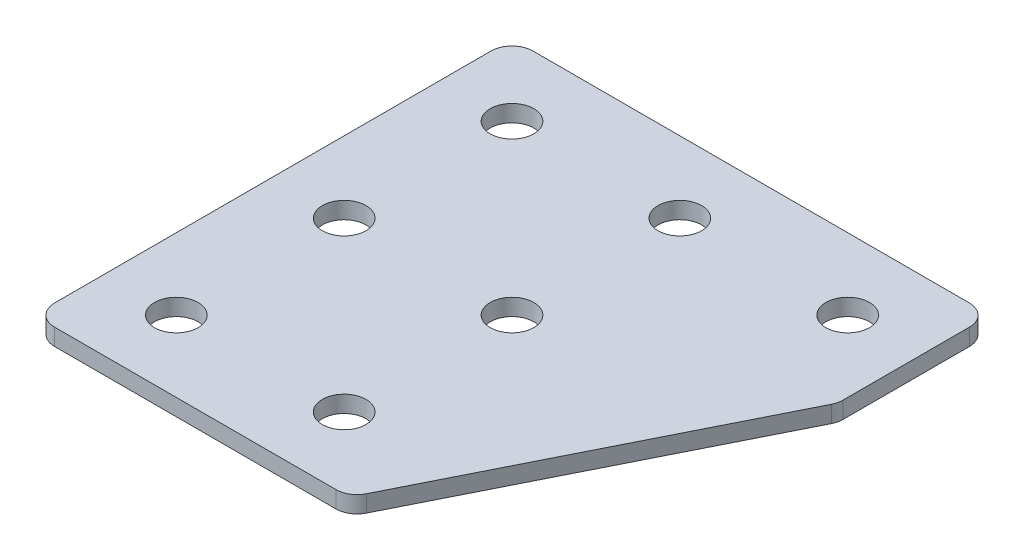
ISO-10303-21;
HEADER;
FILE_DESCRIPTION(('STEP AP214'),'2;1');
FILE_NAME('part.step','',(''),(''),'','','');
FILE_SCHEMA(('AUTOMOTIVE_DESIGN { 1 0 10303 214 1 1 1 1 }'));
ENDSEC;
DATA;
#1=APPLICATION_CONTEXT('core data for automotive mechanical design processes');
#2=APPLICATION_PROTOCOL_DEFINITION('international standard','automotive_design',2000,#1);
#3=PRODUCT_CONTEXT('',#1,'mechanical');
#4=PRODUCT('Part','Part','',(#3));
#5=PRODUCT_RELATED_PRODUCT_CATEGORY('part','',(#4));
#6=PRODUCT_DEFINITION_FORMATION('','',#4);
#7=PRODUCT_DEFINITION_CONTEXT('part definition',#1,'design');
#8=PRODUCT_DEFINITION('design','',#6,#7);
#9=PRODUCT_DEFINITION_SHAPE('','',#8);
#10=(LENGTH_UNIT() NAMED_UNIT(*) SI_UNIT(.MILLI.,.METRE.));
#11=(NAMED_UNIT(*) PLANE_ANGLE_UNIT() SI_UNIT($,.RADIAN.));
#12=(NAMED_UNIT(*) SI_UNIT($,.STERADIAN.) SOLID_ANGLE_UNIT());
#13=UNCERTAINTY_MEASURE_WITH_UNIT(LENGTH_MEASURE(1.E-05),#10,'distance_accuracy_value','');
#14=(GEOMETRIC_REPRESENTATION_CONTEXT(3) GLOBAL_UNCERTAINTY_ASSIGNED_CONTEXT((#13)) GLOBAL_UNIT_ASSIGNED_CONTEXT((#10,
#11,#12)) REPRESENTATION_CONTEXT('',''));
#15=CARTESIAN_POINT('',(0.,0.,0.));
#16=DIRECTION('',(0.,0.,1.));
#17=DIRECTION('',(1.,0.,0.));
#18=AXIS2_PLACEMENT_3D('',#15,#16,#17);
#19=CARTESIAN_POINT('',(-11.2369089429852,1.27470932668439,-21.0374307097436));
#20=DIRECTION('',(0.,-1.,0.));
#21=DIRECTION('',(0.,0.,-1.));
#22=AXIS2_PLACEMENT_3D('',#19,#20,#21);
#23=PLANE('',#22);
#24=CARTESIAN_POINT('',(-1.23690894298524,1.27470932668439,18.9625692902565));
#25=DIRECTION('',(0.,1.,0.));
#26=DIRECTION('',(0.,0.,1.));
#27=AXIS2_PLACEMENT_3D('',#24,#25,#26);
#28=CIRCLE('',#27,2.6);
#29=CARTESIAN_POINT('',(-1.23690894298524,1.27470932668439,21.5625692902565));
#30=VERTEX_POINT('',#29);
#31=EDGE_CURVE('E257',#30,#30,#28,.T.);
#32=ORIENTED_EDGE('',*,*,#31,.T.);
#33=EDGE_LOOP('',(#32));
#34=FACE_BOUND('',#33,.T.);
#35=CARTESIAN_POINT('',(-21.2369089429853,1.27470932668439,18.9625692902565));
#36=DIRECTION('',(0.,1.,0.));
#37=DIRECTION('',(0.,0.,1.));
#38=AXIS2_PLACEMENT_3D('',#35,#36,#37);
#39=CIRCLE('',#38,2.6);
#40=CARTESIAN_POINT('',(-21.2369089429853,1.27470932668439,21.5625692902565));
#41=VERTEX_POINT('',#40);
#42=EDGE_CURVE('E265',#41,#41,#39,.T.);
#43=ORIENTED_EDGE('',*,*,#42,.T.);
#44=EDGE_LOOP('',(#43));
#45=FACE_BOUND('',#44,.T.);
#46=CARTESIAN_POINT('',(-1.23690894298524,1.27470932668439,-1.03743070974355));
#47=DIRECTION('',(0.,1.,0.));
#48=DIRECTION('',(0.,0.,1.));
#49=AXIS2_PLACEMENT_3D('',#46,#47,#48);
#50=CIRCLE('',#49,2.6);
#51=CARTESIAN_POINT('',(-1.23690894298524,1.27470932668439,1.56256929025645));
#52=VERTEX_POINT('',#51);
#53=EDGE_CURVE('E271',#52,#52,#50,.T.);
#54=ORIENTED_EDGE('',*,*,#53,.T.);
#55=EDGE_LOOP('',(#54));
#56=FACE_BOUND('',#55,.T.);
#57=CARTESIAN_POINT('',(-21.2369089429853,1.27470932668439,-1.03743070974355));
#58=DIRECTION('',(0.,1.,0.));
#59=DIRECTION('',(0.,0.,1.));
#60=AXIS2_PLACEMENT_3D('',#57,#58,#59);
#61=CIRCLE('',#60,2.6);
#62=CARTESIAN_POINT('',(-21.2369089429853,1.27470932668439,1.56256929025645));
#63=VERTEX_POINT('',#62);
#64=EDGE_CURVE('E277',#63,#63,#61,.T.);
#65=ORIENTED_EDGE('',*,*,#64,.T.);
#66=EDGE_LOOP('',(#65));
#67=FACE_BOUND('',#66,.T.);
#68=CARTESIAN_POINT('',(18.7630910570148,1.27470932668439,-21.0374307097436));
#69=DIRECTION('',(0.,1.,0.));
#70=DIRECTION('',(0.,0.,1.));
#71=AXIS2_PLACEMENT_3D('',#68,#69,#70);
#72=CIRCLE('',#71,2.6);
#73=CARTESIAN_POINT('',(18.7630910570148,1.27470932668439,-18.4374307097436));
#74=VERTEX_POINT('',#73);
#75=EDGE_CURVE('E283',#74,#74,#72,.T.);
#76=ORIENTED_EDGE('',*,*,#75,.T.);
#77=EDGE_LOOP('',(#76));
#78=FACE_BOUND('',#77,.T.);
#79=CARTESIAN_POINT('',(-1.23690894298523,1.27470932668439,-21.0374307097436));
#80=DIRECTION('',(0.,1.,0.));
#81=DIRECTION('',(0.,0.,1.));
#82=AXIS2_PLACEMENT_3D('',#79,#80,#81);
#83=CIRCLE('',#82,2.6);
#84=CARTESIAN_POINT('',(-1.23690894298523,1.27470932668439,-18.4374307097436));
#85=VERTEX_POINT('',#84);
#86=EDGE_CURVE('E289',#85,#85,#83,.T.);
#87=ORIENTED_EDGE('',*,*,#86,.T.);
#88=EDGE_LOOP('',(#87));
#89=FACE_BOUND('',#88,.T.);
#90=CARTESIAN_POINT('',(-21.2369089429853,1.27470932668439,-21.0374307097436));
#91=DIRECTION('',(0.,1.,0.));
#92=DIRECTION('',(0.,0.,1.));
#93=AXIS2_PLACEMENT_3D('',#90,#91,#92);
#94=CIRCLE('',#93,2.6);
#95=CARTESIAN_POINT('',(-21.2369089429853,1.27470932668439,-18.4374307097436));
#96=VERTEX_POINT('',#95);
#97=EDGE_CURVE('E176',#96,#96,#94,.T.);
#98=ORIENTED_EDGE('',*,*,#97,.T.);
#99=EDGE_LOOP('',(#98));
#100=FACE_BOUND('',#99,.T.);
#101=DIRECTION('',(1.,0.,0.));
#102=VECTOR('',#101,1.);
#103=CARTESIAN_POINT('',(-29.7369089429853,1.27470932668439,27.4625692902564));
#104=LINE('',#103,#102);
#105=CARTESIAN_POINT('',(-27.2369089429853,1.27470932668439,27.4625692902564));
#106=VERTEX_POINT('',#105);
#107=CARTESIAN_POINT('',(6.29095510201524,1.27470932668439,27.4625692902564));
#108=VERTEX_POINT('',#107);
#109=EDGE_CURVE('E165',#106,#108,#104,.T.);
#110=ORIENTED_EDGE('',*,*,#109,.F.);
#111=CARTESIAN_POINT('',(-27.2369089429853,1.27470932668439,24.9625692902564));
#112=DIRECTION('',(0.,-1.,0.));
#113=DIRECTION('',(0.,0.,-1.));
#114=AXIS2_PLACEMENT_3D('',#111,#112,#113);
#115=CIRCLE('',#114,2.5);
#116=CARTESIAN_POINT('',(-29.7369089429853,1.27470932668439,24.9625692902564));
#117=VERTEX_POINT('',#116);
#118=EDGE_CURVE('E146',#106,#117,#115,.T.);
#119=ORIENTED_EDGE('',*,*,#118,.T.);
#120=DIRECTION('',(0.,0.,1.));
#121=VECTOR('',#120,1.);
#122=CARTESIAN_POINT('',(-29.7369089429853,1.27470932668439,-29.5374307097436));
#123=LINE('',#122,#121);
#124=CARTESIAN_POINT('',(-29.7369089429853,1.27470932668439,-27.0374307097436));
#125=VERTEX_POINT('',#124);
#126=EDGE_CURVE('E163',#125,#117,#123,.T.);
#127=ORIENTED_EDGE('',*,*,#126,.F.);
#128=CARTESIAN_POINT('',(-27.2369089429853,1.27470932668439,-27.0374307097436));
#129=DIRECTION('',(0.,-1.,0.));
#130=DIRECTION('',(0.,0.,-1.));
#131=AXIS2_PLACEMENT_3D('',#128,#129,#130);
#132=CIRCLE('',#131,2.5);
#133=CARTESIAN_POINT('',(-27.2369089429853,1.27470932668439,-29.5374307097436));
#134=VERTEX_POINT('',#133);
#135=EDGE_CURVE('E117',#125,#134,#132,.T.);
#136=ORIENTED_EDGE('',*,*,#135,.T.);
#137=DIRECTION('',(-1.,0.,0.));
#138=VECTOR('',#137,1.);
#139=CARTESIAN_POINT('',(27.2630910570147,1.27470932668439,-29.5374307097436));
#140=LINE('',#139,#138);
#141=CARTESIAN_POINT('',(24.7630910570147,1.27470932668439,-29.5374307097436));
#142=VERTEX_POINT('',#141);
#143=EDGE_CURVE('E161',#142,#134,#140,.T.);
#144=ORIENTED_EDGE('',*,*,#143,.F.);
#145=CARTESIAN_POINT('',(24.7630910570147,1.27470932668439,-27.0374307097436));
#146=DIRECTION('',(0.,-1.,0.));
#147=DIRECTION('',(0.,0.,-1.));
#148=AXIS2_PLACEMENT_3D('',#145,#146,#147);
#149=CIRCLE('',#148,2.5);
#150=CARTESIAN_POINT('',(27.2630910570147,1.27470932668439,-27.0374307097436));
#151=VERTEX_POINT('',#150);
#152=EDGE_CURVE('E141',#142,#151,#149,.T.);
#153=ORIENTED_EDGE('',*,*,#152,.T.);
#154=DIRECTION('',(0.,0.,-1.));
#155=VECTOR('',#154,1.);
#156=CARTESIAN_POINT('',(27.2630910570147,1.27470932668439,-11.3915326759932));
#157=LINE('',#156,#155);
#158=CARTESIAN_POINT('',(27.2630910570147,1.27470932668439,-11.9817026197427));
#159=VERTEX_POINT('',#158);
#160=EDGE_CURVE('E118',#159,#151,#157,.T.);
#161=ORIENTED_EDGE('',*,*,#160,.F.);
#162=CARTESIAN_POINT('',(24.7630910570147,1.27470932668439,-11.9817026197427));
#163=DIRECTION('',(0.,-1.,0.));
#164=DIRECTION('',(0.,0.,-1.));
#165=AXIS2_PLACEMENT_3D('',#162,#163,#164);
#166=CIRCLE('',#165,2.5);
#167=CARTESIAN_POINT('',(26.9991590345144,1.27470932668439,-10.8636686309928));
#168=VERTEX_POINT('',#167);
#169=EDGE_CURVE('E31',#159,#168,#166,.T.);
#170=ORIENTED_EDGE('',*,*,#169,.T.);
#171=DIRECTION('',(0.447213595499955,0.,-0.894427190999917));
#172=VECTOR('',#171,1.);
#173=CARTESIAN_POINT('',(7.83604007388999,1.27470932668439,27.4625692902564));
#174=LINE('',#173,#172);
#175=CARTESIAN_POINT('',(8.52702307951504,1.27470932668439,26.0806032790063));
#176=VERTEX_POINT('',#175);
#177=EDGE_CURVE('E122',#176,#168,#174,.T.);
#178=ORIENTED_EDGE('',*,*,#177,.F.);
#179=CARTESIAN_POINT('',(6.29095510201524,1.27470932668439,24.9625692902564));
#180=DIRECTION('',(0.,-1.,0.));
#181=DIRECTION('',(0.,0.,-1.));
#182=AXIS2_PLACEMENT_3D('',#179,#180,#181);
#183=CIRCLE('',#182,2.5);
#184=EDGE_CURVE('E144',#176,#108,#183,.T.);
#185=ORIENTED_EDGE('',*,*,#184,.T.);
#186=EDGE_LOOP('',(#110,#119,#127,#136,#144,#153,#161,#170,#178,#185));
#187=FACE_BOUND('',#186,.T.);
#188=ADVANCED_FACE('F16',(#34,#45,#56,#67,#78,#89,#100,#187),#23,.T.);
#189=CARTESIAN_POINT('',(27.2630910570147,1.27470932668439,-29.5374307097436));
#190=DIRECTION('',(0.,0.,-1.));
#191=DIRECTION('',(-1.,0.,0.));
#192=AXIS2_PLACEMENT_3D('',#189,#190,#191);
#193=PLANE('',#192);
#194=DIRECTION('',(-1.,0.,0.));
#195=VECTOR('',#194,1.);
#196=CARTESIAN_POINT('',(27.2630910570147,3.27470932668439,-29.5374307097436));
#197=LINE('',#196,#195);
#198=CARTESIAN_POINT('',(24.7630910570147,3.27470932668439,-29.5374307097436));
#199=VERTEX_POINT('',#198);
#200=CARTESIAN_POINT('',(-27.2369089429853,3.27470932668439,-29.5374307097436));
#201=VERTEX_POINT('',#200);
#202=EDGE_CURVE('E99',#199,#201,#197,.T.);
#203=ORIENTED_EDGE('',*,*,#202,.F.);
#204=DIRECTION('',(0.,1.,0.));
#205=VECTOR('',#204,1.);
#206=CARTESIAN_POINT('',(24.7630910570147,1.27470932668439,-29.5374307097436));
#207=LINE('',#206,#205);
#208=EDGE_CURVE('E10',#199,#142,#207,.F.);
#209=ORIENTED_EDGE('',*,*,#208,.T.);
#210=ORIENTED_EDGE('',*,*,#143,.T.);
#211=DIRECTION('',(0.,1.,0.));
#212=VECTOR('',#211,1.);
#213=CARTESIAN_POINT('',(-27.2369089429853,1.27470932668439,-29.5374307097436));
#214=LINE('',#213,#212);
#215=EDGE_CURVE('E24',#134,#201,#214,.T.);
#216=ORIENTED_EDGE('',*,*,#215,.T.);
#217=EDGE_LOOP('',(#203,#209,#210,#216));
#218=FACE_BOUND('',#217,.T.);
#219=ADVANCED_FACE('F158',(#218),#193,.T.);
#220=CARTESIAN_POINT('',(27.2630910570147,1.27470932668439,-11.3915326759932));
#221=DIRECTION('',(1.,0.,0.));
#222=DIRECTION('',(0.,0.,-1.));
#223=AXIS2_PLACEMENT_3D('',#220,#221,#222);
#224=PLANE('',#223);
#225=DIRECTION('',(0.,0.,-1.));
#226=VECTOR('',#225,1.);
#227=CARTESIAN_POINT('',(27.2630910570147,3.27470932668439,-11.3915326759932));
#228=LINE('',#227,#226);
#229=CARTESIAN_POINT('',(27.2630910570147,3.27470932668439,-11.9817026197427));
#230=VERTEX_POINT('',#229);
#231=CARTESIAN_POINT('',(27.2630910570147,3.27470932668439,-27.0374307097436));
#232=VERTEX_POINT('',#231);
#233=EDGE_CURVE('E125',#230,#232,#228,.T.);
#234=ORIENTED_EDGE('',*,*,#233,.F.);
#235=DIRECTION('',(0.,1.,0.));
#236=VECTOR('',#235,1.);
#237=CARTESIAN_POINT('',(27.2630910570147,1.27470932668439,-11.9817026197427));
#238=LINE('',#237,#236);
#239=EDGE_CURVE('E155',#230,#159,#238,.F.);
#240=ORIENTED_EDGE('',*,*,#239,.T.);
#241=ORIENTED_EDGE('',*,*,#160,.T.);
#242=DIRECTION('',(0.,1.,0.));
#243=VECTOR('',#242,1.);
#244=CARTESIAN_POINT('',(27.2630910570147,1.27470932668439,-27.0374307097436));
#245=LINE('',#244,#243);
#246=EDGE_CURVE('E152',#151,#232,#245,.T.);
#247=ORIENTED_EDGE('',*,*,#246,.T.);
#248=EDGE_LOOP('',(#234,#240,#241,#247));
#249=FACE_BOUND('',#248,.T.);
#250=ADVANCED_FACE('F212',(#249),#224,.T.);
#251=CARTESIAN_POINT('',(7.83604007388999,1.27470932668439,27.4625692902564));
#252=DIRECTION('',(0.894427190999917,0.,0.447213595499955));
#253=DIRECTION('',(0.447213595499955,0.,-0.894427190999917));
#254=AXIS2_PLACEMENT_3D('',#251,#252,#253);
#255=PLANE('',#254);
#256=DIRECTION('',(0.447213595499955,0.,-0.894427190999917));
#257=VECTOR('',#256,1.);
#258=CARTESIAN_POINT('',(7.83604007388999,3.27470932668439,27.4625692902564));
#259=LINE('',#258,#257);
#260=CARTESIAN_POINT('',(8.52702307951504,3.27470932668439,26.0806032790063));
#261=VERTEX_POINT('',#260);
#262=CARTESIAN_POINT('',(26.9991590345144,3.27470932668439,-10.8636686309928));
#263=VERTEX_POINT('',#262);
#264=EDGE_CURVE('E168',#261,#263,#259,.T.);
#265=ORIENTED_EDGE('',*,*,#264,.F.);
#266=DIRECTION('',(0.,1.,0.));
#267=VECTOR('',#266,1.);
#268=CARTESIAN_POINT('',(8.52702307951504,1.27470932668439,26.0806032790063));
#269=LINE('',#268,#267);
#270=EDGE_CURVE('E38',#261,#176,#269,.F.);
#271=ORIENTED_EDGE('',*,*,#270,.T.);
#272=ORIENTED_EDGE('',*,*,#177,.T.);
#273=DIRECTION('',(0.,1.,0.));
#274=VECTOR('',#273,1.);
#275=CARTESIAN_POINT('',(26.9991590345145,1.27470932668439,-10.8636686309928));
#276=LINE('',#275,#274);
#277=EDGE_CURVE('E148',#168,#263,#276,.T.);
#278=ORIENTED_EDGE('',*,*,#277,.T.);
#279=EDGE_LOOP('',(#265,#271,#272,#278));
#280=FACE_BOUND('',#279,.T.);
#281=ADVANCED_FACE('F181',(#280),#255,.T.);
#282=CARTESIAN_POINT('',(-29.7369089429853,1.27470932668439,27.4625692902564));
#283=DIRECTION('',(0.,0.,1.));
#284=DIRECTION('',(1.,0.,0.));
#285=AXIS2_PLACEMENT_3D('',#282,#283,#284);
#286=PLANE('',#285);
#287=DIRECTION('',(1.,0.,0.));
#288=VECTOR('',#287,1.);
#289=CARTESIAN_POINT('',(-29.7369089429853,3.27470932668439,27.4625692902564));
#290=LINE('',#289,#288);
#291=CARTESIAN_POINT('',(-27.2369089429853,3.27470932668439,27.4625692902564));
#292=VERTEX_POINT('',#291);
#293=CARTESIAN_POINT('',(6.29095510201524,3.27470932668439,27.4625692902564));
#294=VERTEX_POINT('',#293);
#295=EDGE_CURVE('E114',#292,#294,#290,.T.);
#296=ORIENTED_EDGE('',*,*,#295,.F.);
#297=DIRECTION('',(0.,1.,0.));
#298=VECTOR('',#297,1.);
#299=CARTESIAN_POINT('',(-27.2369089429853,1.27470932668439,27.4625692902564));
#300=LINE('',#299,#298);
#301=EDGE_CURVE('E138',#292,#106,#300,.F.);
#302=ORIENTED_EDGE('',*,*,#301,.T.);
#303=ORIENTED_EDGE('',*,*,#109,.T.);
#304=DIRECTION('',(0.,1.,0.));
#305=VECTOR('',#304,1.);
#306=CARTESIAN_POINT('',(6.29095510201524,1.27470932668439,27.4625692902564));
#307=LINE('',#306,#305);
#308=EDGE_CURVE('E135',#108,#294,#307,.T.);
#309=ORIENTED_EDGE('',*,*,#308,.T.);
#310=EDGE_LOOP('',(#296,#302,#303,#309));
#311=FACE_BOUND('',#310,.T.);
#312=ADVANCED_FACE('F191',(#311),#286,.T.);
#313=CARTESIAN_POINT('',(-29.7369089429853,1.27470932668439,-29.5374307097436));
#314=DIRECTION('',(-1.,0.,0.));
#315=DIRECTION('',(0.,0.,1.));
#316=AXIS2_PLACEMENT_3D('',#313,#314,#315);
#317=PLANE('',#316);
#318=ORIENTED_EDGE('',*,*,#126,.T.);
#319=DIRECTION('',(0.,1.,0.));
#320=VECTOR('',#319,1.);
#321=CARTESIAN_POINT('',(-29.7369089429853,1.27470932668439,24.9625692902564));
#322=LINE('',#321,#320);
#323=CARTESIAN_POINT('',(-29.7369089429853,3.27470932668439,24.9625692902564));
#324=VERTEX_POINT('',#323);
#325=EDGE_CURVE('E105',#117,#324,#322,.T.);
#326=ORIENTED_EDGE('',*,*,#325,.T.);
#327=DIRECTION('',(0.,0.,1.));
#328=VECTOR('',#327,1.);
#329=CARTESIAN_POINT('',(-29.7369089429853,3.27470932668439,-29.5374307097436));
#330=LINE('',#329,#328);
#331=CARTESIAN_POINT('',(-29.7369089429853,3.27470932668439,-27.0374307097436));
#332=VERTEX_POINT('',#331);
#333=EDGE_CURVE('E97',#332,#324,#330,.T.);
#334=ORIENTED_EDGE('',*,*,#333,.F.);
#335=DIRECTION('',(0.,1.,0.));
#336=VECTOR('',#335,1.);
#337=CARTESIAN_POINT('',(-29.7369089429853,1.27470932668439,-27.0374307097436));
#338=LINE('',#337,#336);
#339=EDGE_CURVE('E111',#332,#125,#338,.F.);
#340=ORIENTED_EDGE('',*,*,#339,.T.);
#341=EDGE_LOOP('',(#318,#326,#334,#340));
#342=FACE_BOUND('',#341,.T.);
#343=ADVANCED_FACE('F110',(#342),#317,.T.);
#344=CARTESIAN_POINT('',(-11.2369089429852,3.27470932668439,-21.0374307097436));
#345=DIRECTION('',(0.,-1.,0.));
#346=DIRECTION('',(0.,0.,-1.));
#347=AXIS2_PLACEMENT_3D('',#344,#345,#346);
#348=PLANE('',#347);
#349=CARTESIAN_POINT('',(-1.23690894298524,3.27470932668439,18.9625692902565));
#350=DIRECTION('',(0.,1.,0.));
#351=DIRECTION('',(0.,0.,1.));
#352=AXIS2_PLACEMENT_3D('',#349,#350,#351);
#353=CIRCLE('',#352,2.6);
#354=CARTESIAN_POINT('',(-1.23690894298524,3.27470932668439,21.5625692902565));
#355=VERTEX_POINT('',#354);
#356=EDGE_CURVE('E260',#355,#355,#353,.T.);
#357=ORIENTED_EDGE('',*,*,#356,.F.);
#358=EDGE_LOOP('',(#357));
#359=FACE_BOUND('',#358,.T.);
#360=CARTESIAN_POINT('',(-21.2369089429853,3.27470932668439,18.9625692902565));
#361=DIRECTION('',(0.,1.,0.));
#362=DIRECTION('',(0.,0.,1.));
#363=AXIS2_PLACEMENT_3D('',#360,#361,#362);
#364=CIRCLE('',#363,2.6);
#365=CARTESIAN_POINT('',(-21.2369089429853,3.27470932668439,21.5625692902565));
#366=VERTEX_POINT('',#365);
#367=EDGE_CURVE('E262',#366,#366,#364,.T.);
#368=ORIENTED_EDGE('',*,*,#367,.F.);
#369=EDGE_LOOP('',(#368));
#370=FACE_BOUND('',#369,.T.);
#371=CARTESIAN_POINT('',(-1.23690894298524,3.27470932668439,-1.03743070974355));
#372=DIRECTION('',(0.,1.,0.));
#373=DIRECTION('',(0.,0.,1.));
#374=AXIS2_PLACEMENT_3D('',#371,#372,#373);
#375=CIRCLE('',#374,2.6);
#376=CARTESIAN_POINT('',(-1.23690894298524,3.27470932668439,1.56256929025645));
#377=VERTEX_POINT('',#376);
#378=EDGE_CURVE('E268',#377,#377,#375,.T.);
#379=ORIENTED_EDGE('',*,*,#378,.F.);
#380=EDGE_LOOP('',(#379));
#381=FACE_BOUND('',#380,.T.);
#382=CARTESIAN_POINT('',(-21.2369089429853,3.27470932668439,-1.03743070974355));
#383=DIRECTION('',(0.,1.,0.));
#384=DIRECTION('',(0.,0.,1.));
#385=AXIS2_PLACEMENT_3D('',#382,#383,#384);
#386=CIRCLE('',#385,2.6);
#387=CARTESIAN_POINT('',(-21.2369089429853,3.27470932668439,1.56256929025645));
#388=VERTEX_POINT('',#387);
#389=EDGE_CURVE('E274',#388,#388,#386,.T.);
#390=ORIENTED_EDGE('',*,*,#389,.F.);
#391=EDGE_LOOP('',(#390));
#392=FACE_BOUND('',#391,.T.);
#393=CARTESIAN_POINT('',(18.7630910570148,3.27470932668439,-21.0374307097436));
#394=DIRECTION('',(0.,1.,0.));
#395=DIRECTION('',(0.,0.,1.));
#396=AXIS2_PLACEMENT_3D('',#393,#394,#395);
#397=CIRCLE('',#396,2.6);
#398=CARTESIAN_POINT('',(18.7630910570148,3.27470932668439,-18.4374307097436));
#399=VERTEX_POINT('',#398);
#400=EDGE_CURVE('E280',#399,#399,#397,.T.);
#401=ORIENTED_EDGE('',*,*,#400,.F.);
#402=EDGE_LOOP('',(#401));
#403=FACE_BOUND('',#402,.T.);
#404=CARTESIAN_POINT('',(-1.23690894298523,3.27470932668439,-21.0374307097436));
#405=DIRECTION('',(0.,1.,0.));
#406=DIRECTION('',(0.,0.,1.));
#407=AXIS2_PLACEMENT_3D('',#404,#405,#406);
#408=CIRCLE('',#407,2.6);
#409=CARTESIAN_POINT('',(-1.23690894298523,3.27470932668439,-18.4374307097436));
#410=VERTEX_POINT('',#409);
#411=EDGE_CURVE('E286',#410,#410,#408,.T.);
#412=ORIENTED_EDGE('',*,*,#411,.F.);
#413=EDGE_LOOP('',(#412));
#414=FACE_BOUND('',#413,.T.);
#415=CARTESIAN_POINT('',(-21.2369089429853,3.27470932668439,-21.0374307097436));
#416=DIRECTION('',(0.,1.,0.));
#417=DIRECTION('',(0.,0.,1.));
#418=AXIS2_PLACEMENT_3D('',#415,#416,#417);
#419=CIRCLE('',#418,2.6);
#420=CARTESIAN_POINT('',(-21.2369089429853,3.27470932668439,-18.4374307097436));
#421=VERTEX_POINT('',#420);
#422=EDGE_CURVE('E170',#421,#421,#419,.T.);
#423=ORIENTED_EDGE('',*,*,#422,.F.);
#424=EDGE_LOOP('',(#423));
#425=FACE_BOUND('',#424,.T.);
#426=ORIENTED_EDGE('',*,*,#333,.T.);
#427=CARTESIAN_POINT('',(-27.2369089429853,3.27470932668439,24.9625692902564));
#428=DIRECTION('',(0.,-1.,0.));
#429=DIRECTION('',(0.,0.,-1.));
#430=AXIS2_PLACEMENT_3D('',#427,#428,#429);
#431=CIRCLE('',#430,2.5);
#432=EDGE_CURVE('E133',#324,#292,#431,.F.);
#433=ORIENTED_EDGE('',*,*,#432,.T.);
#434=ORIENTED_EDGE('',*,*,#295,.T.);
#435=CARTESIAN_POINT('',(6.29095510201524,3.27470932668439,24.9625692902564));
#436=DIRECTION('',(0.,-1.,0.));
#437=DIRECTION('',(0.,0.,-1.));
#438=AXIS2_PLACEMENT_3D('',#435,#436,#437);
#439=CIRCLE('',#438,2.5);
#440=EDGE_CURVE('E131',#294,#261,#439,.F.);
#441=ORIENTED_EDGE('',*,*,#440,.T.);
#442=ORIENTED_EDGE('',*,*,#264,.T.);
#443=CARTESIAN_POINT('',(24.7630910570147,3.27470932668439,-11.9817026197427));
#444=DIRECTION('',(0.,-1.,0.));
#445=DIRECTION('',(0.,0.,-1.));
#446=AXIS2_PLACEMENT_3D('',#443,#444,#445);
#447=CIRCLE('',#446,2.5);
#448=EDGE_CURVE('E129',#263,#230,#447,.F.);
#449=ORIENTED_EDGE('',*,*,#448,.T.);
#450=ORIENTED_EDGE('',*,*,#233,.T.);
#451=CARTESIAN_POINT('',(24.7630910570147,3.27470932668439,-27.0374307097436));
#452=DIRECTION('',(0.,-1.,0.));
#453=DIRECTION('',(0.,0.,-1.));
#454=AXIS2_PLACEMENT_3D('',#451,#452,#453);
#455=CIRCLE('',#454,2.5);
#456=EDGE_CURVE('E104',#232,#199,#455,.F.);
#457=ORIENTED_EDGE('',*,*,#456,.T.);
#458=ORIENTED_EDGE('',*,*,#202,.T.);
#459=CARTESIAN_POINT('',(-27.2369089429853,3.27470932668439,-27.0374307097436));
#460=DIRECTION('',(0.,-1.,0.));
#461=DIRECTION('',(0.,0.,-1.));
#462=AXIS2_PLACEMENT_3D('',#459,#460,#461);
#463=CIRCLE('',#462,2.5);
#464=EDGE_CURVE('E94',#201,#332,#463,.F.);
#465=ORIENTED_EDGE('',*,*,#464,.T.);
#466=EDGE_LOOP('',(#426,#433,#434,#441,#442,#449,#450,#457,#458,#465));
#467=FACE_BOUND('',#466,.T.);
#468=ADVANCED_FACE('F96',(#359,#370,#381,#392,#403,#414,#425,#467),#348,.F.);
#469=CARTESIAN_POINT('',(-27.2369089429853,1.27470932668439,24.9625692902564));
#470=DIRECTION('',(0.,1.,0.));
#471=DIRECTION('',(0.,0.,1.));
#472=AXIS2_PLACEMENT_3D('',#469,#470,#471);
#473=CYLINDRICAL_SURFACE('',#472,2.5);
#474=ORIENTED_EDGE('',*,*,#118,.F.);
#475=ORIENTED_EDGE('',*,*,#301,.F.);
#476=ORIENTED_EDGE('',*,*,#432,.F.);
#477=ORIENTED_EDGE('',*,*,#325,.F.);
#478=EDGE_LOOP('',(#474,#475,#476,#477));
#479=FACE_BOUND('',#478,.T.);
#480=ADVANCED_FACE('F194',(#479),#473,.T.);
#481=CARTESIAN_POINT('',(6.29095510201524,1.27470932668439,24.9625692902564));
#482=DIRECTION('',(0.,1.,0.));
#483=DIRECTION('',(0.,0.,1.));
#484=AXIS2_PLACEMENT_3D('',#481,#482,#483);
#485=CYLINDRICAL_SURFACE('',#484,2.5);
#486=ORIENTED_EDGE('',*,*,#184,.F.);
#487=ORIENTED_EDGE('',*,*,#270,.F.);
#488=ORIENTED_EDGE('',*,*,#440,.F.);
#489=ORIENTED_EDGE('',*,*,#308,.F.);
#490=EDGE_LOOP('',(#486,#487,#488,#489));
#491=FACE_BOUND('',#490,.T.);
#492=ADVANCED_FACE('F185',(#491),#485,.T.);
#493=CARTESIAN_POINT('',(24.7630910570147,1.27470932668439,-11.9817026197427));
#494=DIRECTION('',(0.,1.,0.));
#495=DIRECTION('',(0.,0.,1.));
#496=AXIS2_PLACEMENT_3D('',#493,#494,#495);
#497=CYLINDRICAL_SURFACE('',#496,2.5);
#498=ORIENTED_EDGE('',*,*,#169,.F.);
#499=ORIENTED_EDGE('',*,*,#239,.F.);
#500=ORIENTED_EDGE('',*,*,#448,.F.);
#501=ORIENTED_EDGE('',*,*,#277,.F.);
#502=EDGE_LOOP('',(#498,#499,#500,#501));
#503=FACE_BOUND('',#502,.T.);
#504=ADVANCED_FACE('F202',(#503),#497,.T.);
#505=CARTESIAN_POINT('',(24.7630910570147,1.27470932668439,-27.0374307097436));
#506=DIRECTION('',(0.,1.,0.));
#507=DIRECTION('',(0.,0.,1.));
#508=AXIS2_PLACEMENT_3D('',#505,#506,#507);
#509=CYLINDRICAL_SURFACE('',#508,2.5);
#510=ORIENTED_EDGE('',*,*,#152,.F.);
#511=ORIENTED_EDGE('',*,*,#208,.F.);
#512=ORIENTED_EDGE('',*,*,#456,.F.);
#513=ORIENTED_EDGE('',*,*,#246,.F.);
#514=EDGE_LOOP('',(#510,#511,#512,#513));
#515=FACE_BOUND('',#514,.T.);
#516=ADVANCED_FACE('F356',(#515),#509,.T.);
#517=CARTESIAN_POINT('',(-27.2369089429853,1.27470932668439,-27.0374307097436));
#518=DIRECTION('',(0.,1.,0.));
#519=DIRECTION('',(0.,0.,1.));
#520=AXIS2_PLACEMENT_3D('',#517,#518,#519);
#521=CYLINDRICAL_SURFACE('',#520,2.5);
#522=ORIENTED_EDGE('',*,*,#135,.F.);
#523=ORIENTED_EDGE('',*,*,#339,.F.);
#524=ORIENTED_EDGE('',*,*,#464,.F.);
#525=ORIENTED_EDGE('',*,*,#215,.F.);
#526=EDGE_LOOP('',(#522,#523,#524,#525));
#527=FACE_BOUND('',#526,.T.);
#528=ADVANCED_FACE('F18',(#527),#521,.T.);
#529=CARTESIAN_POINT('',(-21.2369089429853,1.27470932668439,-21.0374307097436));
#530=DIRECTION('',(0.,1.,0.));
#531=DIRECTION('',(0.,0.,1.));
#532=AXIS2_PLACEMENT_3D('',#529,#530,#531);
#533=CYLINDRICAL_SURFACE('',#532,2.6);
#534=ORIENTED_EDGE('',*,*,#97,.F.);
#535=EDGE_LOOP('',(#534));
#536=FACE_BOUND('',#535,.T.);
#537=ORIENTED_EDGE('',*,*,#422,.T.);
#538=EDGE_LOOP('',(#537));
#539=FACE_BOUND('',#538,.T.);
#540=ADVANCED_FACE('F226',(#536,#539),#533,.F.);
#541=CARTESIAN_POINT('',(-1.23690894298523,1.27470932668439,-21.0374307097436));
#542=DIRECTION('',(0.,1.,0.));
#543=DIRECTION('',(0.,0.,1.));
#544=AXIS2_PLACEMENT_3D('',#541,#542,#543);
#545=CYLINDRICAL_SURFACE('',#544,2.6);
#546=ORIENTED_EDGE('',*,*,#86,.F.);
#547=EDGE_LOOP('',(#546));
#548=FACE_BOUND('',#547,.T.);
#549=ORIENTED_EDGE('',*,*,#411,.T.);
#550=EDGE_LOOP('',(#549));
#551=FACE_BOUND('',#550,.T.);
#552=ADVANCED_FACE('F229',(#548,#551),#545,.F.);
#553=CARTESIAN_POINT('',(18.7630910570148,1.27470932668439,-21.0374307097436));
#554=DIRECTION('',(0.,1.,0.));
#555=DIRECTION('',(0.,0.,1.));
#556=AXIS2_PLACEMENT_3D('',#553,#554,#555);
#557=CYLINDRICAL_SURFACE('',#556,2.6);
#558=ORIENTED_EDGE('',*,*,#75,.F.);
#559=EDGE_LOOP('',(#558));
#560=FACE_BOUND('',#559,.T.);
#561=ORIENTED_EDGE('',*,*,#400,.T.);
#562=EDGE_LOOP('',(#561));
#563=FACE_BOUND('',#562,.T.);
#564=ADVANCED_FACE('F233',(#560,#563),#557,.F.);
#565=CARTESIAN_POINT('',(-21.2369089429853,1.27470932668439,-1.03743070974355));
#566=DIRECTION('',(0.,1.,0.));
#567=DIRECTION('',(0.,0.,1.));
#568=AXIS2_PLACEMENT_3D('',#565,#566,#567);
#569=CYLINDRICAL_SURFACE('',#568,2.6);
#570=ORIENTED_EDGE('',*,*,#64,.F.);
#571=EDGE_LOOP('',(#570));
#572=FACE_BOUND('',#571,.T.);
#573=ORIENTED_EDGE('',*,*,#389,.T.);
#574=EDGE_LOOP('',(#573));
#575=FACE_BOUND('',#574,.T.);
#576=ADVANCED_FACE('F237',(#572,#575),#569,.F.);
#577=CARTESIAN_POINT('',(-1.23690894298524,1.27470932668439,-1.03743070974355));
#578=DIRECTION('',(0.,1.,0.));
#579=DIRECTION('',(0.,0.,1.));
#580=AXIS2_PLACEMENT_3D('',#577,#578,#579);
#581=CYLINDRICAL_SURFACE('',#580,2.6);
#582=ORIENTED_EDGE('',*,*,#53,.F.);
#583=EDGE_LOOP('',(#582));
#584=FACE_BOUND('',#583,.T.);
#585=ORIENTED_EDGE('',*,*,#378,.T.);
#586=EDGE_LOOP('',(#585));
#587=FACE_BOUND('',#586,.T.);
#588=ADVANCED_FACE('F241',(#584,#587),#581,.F.);
#589=CARTESIAN_POINT('',(-21.2369089429853,1.27470932668439,18.9625692902565));
#590=DIRECTION('',(0.,1.,0.));
#591=DIRECTION('',(0.,0.,1.));
#592=AXIS2_PLACEMENT_3D('',#589,#590,#591);
#593=CYLINDRICAL_SURFACE('',#592,2.6);
#594=ORIENTED_EDGE('',*,*,#42,.F.);
#595=EDGE_LOOP('',(#594));
#596=FACE_BOUND('',#595,.T.);
#597=ORIENTED_EDGE('',*,*,#367,.T.);
#598=EDGE_LOOP('',(#597));
#599=FACE_BOUND('',#598,.T.);
#600=ADVANCED_FACE('F245',(#596,#599),#593,.F.);
#601=CARTESIAN_POINT('',(-1.23690894298524,1.27470932668439,18.9625692902565));
#602=DIRECTION('',(0.,1.,0.));
#603=DIRECTION('',(0.,0.,1.));
#604=AXIS2_PLACEMENT_3D('',#601,#602,#603);
#605=CYLINDRICAL_SURFACE('',#604,2.6);
#606=ORIENTED_EDGE('',*,*,#31,.F.);
#607=EDGE_LOOP('',(#606));
#608=FACE_BOUND('',#607,.T.);
#609=ORIENTED_EDGE('',*,*,#356,.T.);
#610=EDGE_LOOP('',(#609));
#611=FACE_BOUND('',#610,.T.);
#612=ADVANCED_FACE('F249',(#608,#611),#605,.F.);
#613=CLOSED_SHELL('',(#188,#219,#250,#281,#312,#343,#468,#480,#492,#504,#516,#528,#540,#552,
#564,#576,#588,#600,#612));
#614=MANIFOLD_SOLID_BREP('B1',#613);
#615=ADVANCED_BREP_SHAPE_REPRESENTATION('',(#18,#614),#14);
#616=SHAPE_DEFINITION_REPRESENTATION(#9,#615);
ENDSEC;
END-ISO-10303-21;
